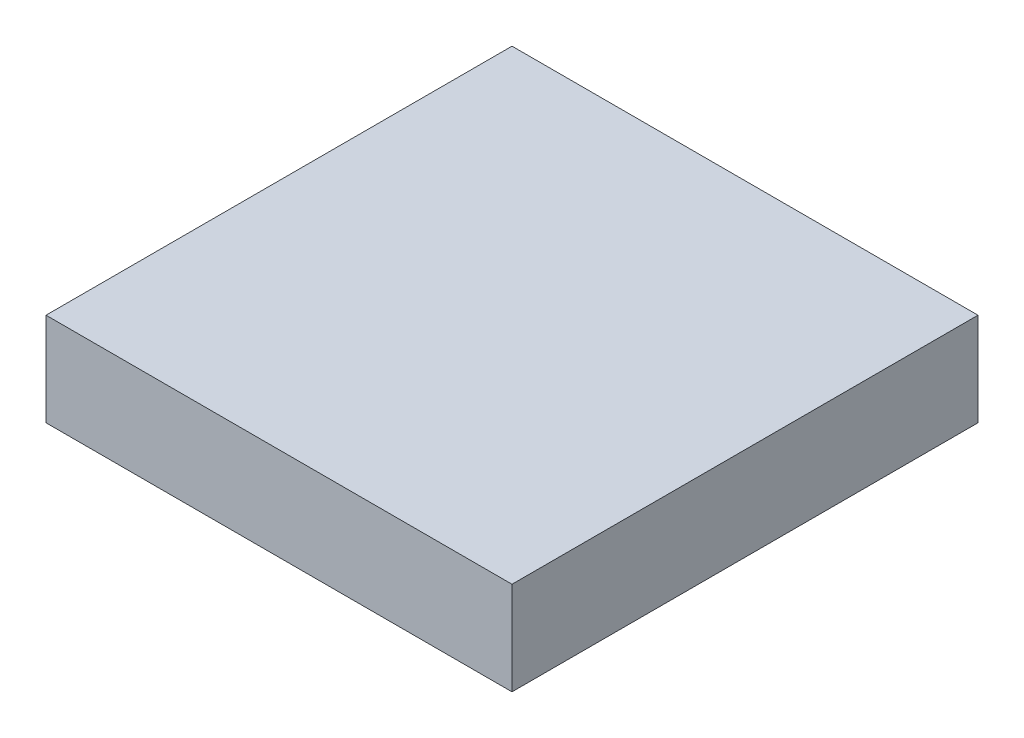
ISO-10303-21;
HEADER;
FILE_DESCRIPTION(('STEP AP214'),'2;1');
FILE_NAME('part.step','',(''),(''),'','','');
FILE_SCHEMA(('AUTOMOTIVE_DESIGN { 1 0 10303 214 1 1 1 1 }'));
ENDSEC;
DATA;
#1=APPLICATION_CONTEXT('core data for automotive mechanical design processes');
#2=APPLICATION_PROTOCOL_DEFINITION('international standard','automotive_design',2000,#1);
#3=PRODUCT_CONTEXT('',#1,'mechanical');
#4=PRODUCT('Part','Part','',(#3));
#5=PRODUCT_RELATED_PRODUCT_CATEGORY('part','',(#4));
#6=PRODUCT_DEFINITION_FORMATION('','',#4);
#7=PRODUCT_DEFINITION_CONTEXT('part definition',#1,'design');
#8=PRODUCT_DEFINITION('design','',#6,#7);
#9=PRODUCT_DEFINITION_SHAPE('','',#8);
#10=(LENGTH_UNIT() NAMED_UNIT(*) SI_UNIT(.MILLI.,.METRE.));
#11=(NAMED_UNIT(*) PLANE_ANGLE_UNIT() SI_UNIT($,.RADIAN.));
#12=(NAMED_UNIT(*) SI_UNIT($,.STERADIAN.) SOLID_ANGLE_UNIT());
#13=UNCERTAINTY_MEASURE_WITH_UNIT(LENGTH_MEASURE(1.E-05),#10,'distance_accuracy_value','');
#14=(GEOMETRIC_REPRESENTATION_CONTEXT(3) GLOBAL_UNCERTAINTY_ASSIGNED_CONTEXT((#13)) GLOBAL_UNIT_ASSIGNED_CONTEXT((#10,
#11,#12)) REPRESENTATION_CONTEXT('',''));
#15=CARTESIAN_POINT('',(0.,0.,0.));
#16=DIRECTION('',(0.,0.,1.));
#17=DIRECTION('',(1.,0.,0.));
#18=AXIS2_PLACEMENT_3D('',#15,#16,#17);
#19=CARTESIAN_POINT('',(0.,5080.,0.));
#20=DIRECTION('',(1.,0.,0.));
#21=DIRECTION('',(0.,0.,-1.));
#22=AXIS2_PLACEMENT_3D('',#19,#20,#21);
#23=PLANE('',#22);
#24=DIRECTION('',(0.,0.,1.));
#25=VECTOR('',#24,1.);
#26=CARTESIAN_POINT('',(0.,0.,0.));
#27=LINE('',#26,#25);
#28=CARTESIAN_POINT('',(0.,0.,-25400.));
#29=VERTEX_POINT('',#28);
#30=CARTESIAN_POINT('',(0.,0.,0.));
#31=VERTEX_POINT('',#30);
#32=EDGE_CURVE('E99',#29,#31,#27,.T.);
#33=ORIENTED_EDGE('',*,*,#32,.T.);
#34=DIRECTION('',(0.,-1.,0.));
#35=VECTOR('',#34,1.);
#36=CARTESIAN_POINT('',(0.,5080.,0.));
#37=LINE('',#36,#35);
#38=CARTESIAN_POINT('',(0.,5080.,0.));
#39=VERTEX_POINT('',#38);
#40=EDGE_CURVE('E11',#39,#31,#37,.T.);
#41=ORIENTED_EDGE('',*,*,#40,.F.);
#42=DIRECTION('',(0.,0.,1.));
#43=VECTOR('',#42,1.);
#44=CARTESIAN_POINT('',(0.,5080.,0.));
#45=LINE('',#44,#43);
#46=CARTESIAN_POINT('',(0.,5080.,-25400.));
#47=VERTEX_POINT('',#46);
#48=EDGE_CURVE('E87',#47,#39,#45,.T.);
#49=ORIENTED_EDGE('',*,*,#48,.F.);
#50=DIRECTION('',(0.,-1.,0.));
#51=VECTOR('',#50,1.);
#52=CARTESIAN_POINT('',(0.,5080.,-25400.));
#53=LINE('',#52,#51);
#54=EDGE_CURVE('E95',#47,#29,#53,.T.);
#55=ORIENTED_EDGE('',*,*,#54,.T.);
#56=EDGE_LOOP('',(#33,#41,#49,#55));
#57=FACE_BOUND('',#56,.T.);
#58=ADVANCED_FACE('F36',(#57),#23,.F.);
#59=CARTESIAN_POINT('',(0.,5080.,0.));
#60=DIRECTION('',(0.,0.,-1.));
#61=DIRECTION('',(-1.,0.,0.));
#62=AXIS2_PLACEMENT_3D('',#59,#60,#61);
#63=PLANE('',#62);
#64=DIRECTION('',(1.,0.,0.));
#65=VECTOR('',#64,1.);
#66=CARTESIAN_POINT('',(0.,0.,0.));
#67=LINE('',#66,#65);
#68=CARTESIAN_POINT('',(25400.,0.,0.));
#69=VERTEX_POINT('',#68);
#70=EDGE_CURVE('E91',#31,#69,#67,.T.);
#71=ORIENTED_EDGE('',*,*,#70,.T.);
#72=DIRECTION('',(0.,-1.,0.));
#73=VECTOR('',#72,1.);
#74=CARTESIAN_POINT('',(25400.,5080.,0.));
#75=LINE('',#74,#73);
#76=CARTESIAN_POINT('',(25400.,5080.,0.));
#77=VERTEX_POINT('',#76);
#78=EDGE_CURVE('E44',#77,#69,#75,.T.);
#79=ORIENTED_EDGE('',*,*,#78,.F.);
#80=DIRECTION('',(1.,0.,0.));
#81=VECTOR('',#80,1.);
#82=CARTESIAN_POINT('',(0.,5080.,0.));
#83=LINE('',#82,#81);
#84=EDGE_CURVE('E82',#39,#77,#83,.T.);
#85=ORIENTED_EDGE('',*,*,#84,.F.);
#86=ORIENTED_EDGE('',*,*,#40,.T.);
#87=EDGE_LOOP('',(#71,#79,#85,#86));
#88=FACE_BOUND('',#87,.T.);
#89=ADVANCED_FACE('F90',(#88),#63,.F.);
#90=CARTESIAN_POINT('',(25400.,5080.,0.));
#91=DIRECTION('',(-1.,0.,0.));
#92=DIRECTION('',(0.,0.,1.));
#93=AXIS2_PLACEMENT_3D('',#90,#91,#92);
#94=PLANE('',#93);
#95=DIRECTION('',(0.,0.,-1.));
#96=VECTOR('',#95,1.);
#97=CARTESIAN_POINT('',(25400.,0.,0.));
#98=LINE('',#97,#96);
#99=CARTESIAN_POINT('',(25400.,0.,-25400.));
#100=VERTEX_POINT('',#99);
#101=EDGE_CURVE('E69',#69,#100,#98,.T.);
#102=ORIENTED_EDGE('',*,*,#101,.T.);
#103=DIRECTION('',(0.,-1.,0.));
#104=VECTOR('',#103,1.);
#105=CARTESIAN_POINT('',(25400.,5080.,-25400.));
#106=LINE('',#105,#104);
#107=CARTESIAN_POINT('',(25400.,5080.,-25400.));
#108=VERTEX_POINT('',#107);
#109=EDGE_CURVE('E92',#108,#100,#106,.T.);
#110=ORIENTED_EDGE('',*,*,#109,.F.);
#111=DIRECTION('',(0.,0.,-1.));
#112=VECTOR('',#111,1.);
#113=CARTESIAN_POINT('',(25400.,5080.,0.));
#114=LINE('',#113,#112);
#115=EDGE_CURVE('E85',#77,#108,#114,.T.);
#116=ORIENTED_EDGE('',*,*,#115,.F.);
#117=ORIENTED_EDGE('',*,*,#78,.T.);
#118=EDGE_LOOP('',(#102,#110,#116,#117));
#119=FACE_BOUND('',#118,.T.);
#120=ADVANCED_FACE('F93',(#119),#94,.F.);
#121=CARTESIAN_POINT('',(0.,5080.,-25400.));
#122=DIRECTION('',(0.,0.,1.));
#123=DIRECTION('',(1.,0.,0.));
#124=AXIS2_PLACEMENT_3D('',#121,#122,#123);
#125=PLANE('',#124);
#126=DIRECTION('',(-1.,0.,0.));
#127=VECTOR('',#126,1.);
#128=CARTESIAN_POINT('',(0.,0.,-25400.));
#129=LINE('',#128,#127);
#130=EDGE_CURVE('E75',#100,#29,#129,.T.);
#131=ORIENTED_EDGE('',*,*,#130,.T.);
#132=ORIENTED_EDGE('',*,*,#54,.F.);
#133=DIRECTION('',(-1.,0.,0.));
#134=VECTOR('',#133,1.);
#135=CARTESIAN_POINT('',(0.,5080.,-25400.));
#136=LINE('',#135,#134);
#137=EDGE_CURVE('E52',#108,#47,#136,.T.);
#138=ORIENTED_EDGE('',*,*,#137,.F.);
#139=ORIENTED_EDGE('',*,*,#109,.T.);
#140=EDGE_LOOP('',(#131,#132,#138,#139));
#141=FACE_BOUND('',#140,.T.);
#142=ADVANCED_FACE('F106',(#141),#125,.F.);
#143=CARTESIAN_POINT('',(0.,5080.,0.));
#144=DIRECTION('',(0.,-1.,0.));
#145=DIRECTION('',(0.,0.,-1.));
#146=AXIS2_PLACEMENT_3D('',#143,#144,#145);
#147=PLANE('',#146);
#148=ORIENTED_EDGE('',*,*,#48,.T.);
#149=ORIENTED_EDGE('',*,*,#84,.T.);
#150=ORIENTED_EDGE('',*,*,#115,.T.);
#151=ORIENTED_EDGE('',*,*,#137,.T.);
#152=EDGE_LOOP('',(#148,#149,#150,#151));
#153=FACE_BOUND('',#152,.T.);
#154=ADVANCED_FACE('F83',(#153),#147,.F.);
#155=CARTESIAN_POINT('',(0.,0.,0.));
#156=DIRECTION('',(0.,-1.,0.));
#157=DIRECTION('',(0.,0.,-1.));
#158=AXIS2_PLACEMENT_3D('',#155,#156,#157);
#159=PLANE('',#158);
#160=ORIENTED_EDGE('',*,*,#32,.F.);
#161=ORIENTED_EDGE('',*,*,#130,.F.);
#162=ORIENTED_EDGE('',*,*,#101,.F.);
#163=ORIENTED_EDGE('',*,*,#70,.F.);
#164=EDGE_LOOP('',(#160,#161,#162,#163));
#165=FACE_BOUND('',#164,.T.);
#166=ADVANCED_FACE('F109',(#165),#159,.T.);
#167=CLOSED_SHELL('',(#58,#89,#120,#142,#154,#166));
#168=MANIFOLD_SOLID_BREP('B2',#167);
#169=ADVANCED_BREP_SHAPE_REPRESENTATION('',(#18,#168),#14);
#170=SHAPE_DEFINITION_REPRESENTATION(#9,#169);
ENDSEC;
END-ISO-10303-21;
